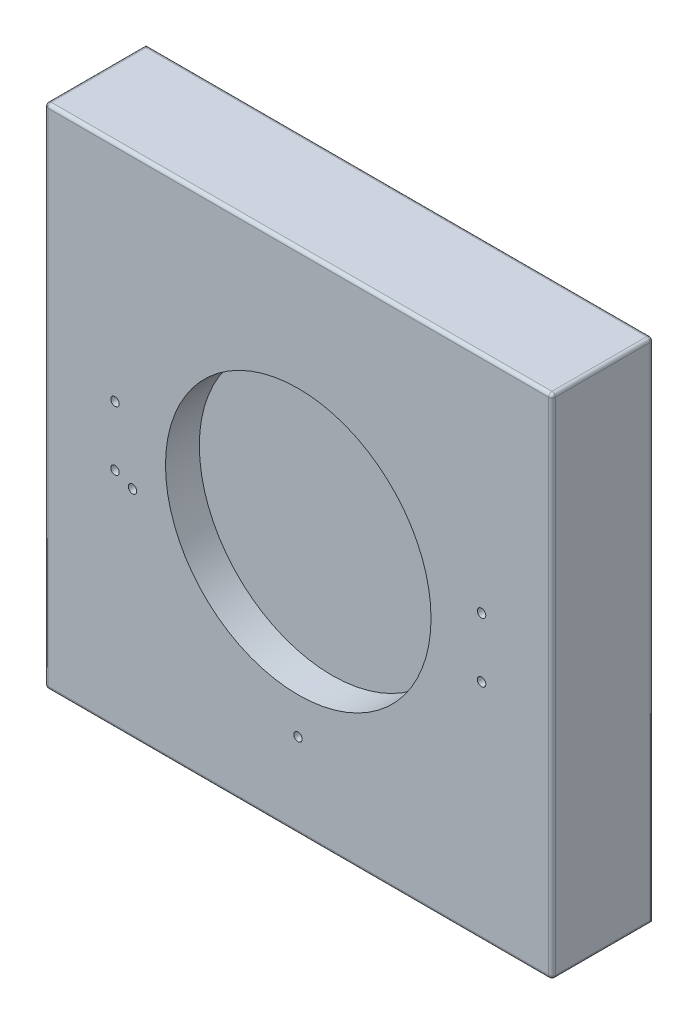
ISO-10303-21;
HEADER;
FILE_DESCRIPTION(('STEP AP214'),'2;1');
FILE_NAME('part.step','',(''),(''),'','','');
FILE_SCHEMA(('AUTOMOTIVE_DESIGN { 1 0 10303 214 1 1 1 1 }'));
ENDSEC;
DATA;
#1=APPLICATION_CONTEXT('core data for automotive mechanical design processes');
#2=APPLICATION_PROTOCOL_DEFINITION('international standard','automotive_design',2000,#1);
#3=PRODUCT_CONTEXT('',#1,'mechanical');
#4=PRODUCT('Part','Part','',(#3));
#5=PRODUCT_RELATED_PRODUCT_CATEGORY('part','',(#4));
#6=PRODUCT_DEFINITION_FORMATION('','',#4);
#7=PRODUCT_DEFINITION_CONTEXT('part definition',#1,'design');
#8=PRODUCT_DEFINITION('design','',#6,#7);
#9=PRODUCT_DEFINITION_SHAPE('','',#8);
#10=(LENGTH_UNIT() NAMED_UNIT(*) SI_UNIT(.MILLI.,.METRE.));
#11=(NAMED_UNIT(*) PLANE_ANGLE_UNIT() SI_UNIT($,.RADIAN.));
#12=(NAMED_UNIT(*) SI_UNIT($,.STERADIAN.) SOLID_ANGLE_UNIT());
#13=UNCERTAINTY_MEASURE_WITH_UNIT(LENGTH_MEASURE(1.E-05),#10,'distance_accuracy_value','');
#14=(GEOMETRIC_REPRESENTATION_CONTEXT(3) GLOBAL_UNCERTAINTY_ASSIGNED_CONTEXT((#13)) GLOBAL_UNIT_ASSIGNED_CONTEXT((#10,
#11,#12)) REPRESENTATION_CONTEXT('',''));
#15=CARTESIAN_POINT('',(0.,0.,0.));
#16=DIRECTION('',(0.,0.,1.));
#17=DIRECTION('',(1.,0.,0.));
#18=AXIS2_PLACEMENT_3D('',#15,#16,#17);
#19=CARTESIAN_POINT('',(-75.,-75.,-30.));
#20=DIRECTION('',(0.,-1.,0.));
#21=DIRECTION('',(0.,0.,-1.));
#22=AXIS2_PLACEMENT_3D('',#19,#20,#21);
#23=PLANE('',#22);
#24=DIRECTION('',(1.,0.,0.));
#25=VECTOR('',#24,1.);
#26=CARTESIAN_POINT('',(-75.,-75.,-30.));
#27=LINE('',#26,#25);
#28=CARTESIAN_POINT('',(-74.,-75.,-30.));
#29=VERTEX_POINT('',#28);
#30=CARTESIAN_POINT('',(74.,-75.,-30.));
#31=VERTEX_POINT('',#30);
#32=EDGE_CURVE('E127',#29,#31,#27,.T.);
#33=ORIENTED_EDGE('',*,*,#32,.T.);
#34=DIRECTION('',(0.,0.,1.));
#35=VECTOR('',#34,1.);
#36=CARTESIAN_POINT('',(74.,-75.,-30.));
#37=LINE('',#36,#35);
#38=CARTESIAN_POINT('',(74.,-75.,-1.));
#39=VERTEX_POINT('',#38);
#40=EDGE_CURVE('E136',#31,#39,#37,.T.);
#41=ORIENTED_EDGE('',*,*,#40,.T.);
#42=DIRECTION('',(1.,0.,0.));
#43=VECTOR('',#42,1.);
#44=CARTESIAN_POINT('',(-75.,-75.,-1.));
#45=LINE('',#44,#43);
#46=CARTESIAN_POINT('',(-74.,-75.,-1.));
#47=VERTEX_POINT('',#46);
#48=EDGE_CURVE('E130',#39,#47,#45,.F.);
#49=ORIENTED_EDGE('',*,*,#48,.T.);
#50=DIRECTION('',(0.,0.,1.));
#51=VECTOR('',#50,1.);
#52=CARTESIAN_POINT('',(-74.,-75.,-30.));
#53=LINE('',#52,#51);
#54=EDGE_CURVE('E124',#47,#29,#53,.F.);
#55=ORIENTED_EDGE('',*,*,#54,.T.);
#56=EDGE_LOOP('',(#33,#41,#49,#55));
#57=FACE_BOUND('',#56,.T.);
#58=ADVANCED_FACE('F40',(#57),#23,.T.);
#59=CARTESIAN_POINT('',(-75.,-75.,-30.));
#60=DIRECTION('',(1.,0.,0.));
#61=DIRECTION('',(0.,0.,-1.));
#62=AXIS2_PLACEMENT_3D('',#59,#60,#61);
#63=PLANE('',#62);
#64=DIRECTION('',(0.,1.,0.));
#65=VECTOR('',#64,1.);
#66=CARTESIAN_POINT('',(-75.,-75.,-30.));
#67=LINE('',#66,#65);
#68=CARTESIAN_POINT('',(-75.,-74.,-30.));
#69=VERTEX_POINT('',#68);
#70=CARTESIAN_POINT('',(-75.,74.,-30.));
#71=VERTEX_POINT('',#70);
#72=EDGE_CURVE('E146',#69,#71,#67,.T.);
#73=ORIENTED_EDGE('',*,*,#72,.F.);
#74=DIRECTION('',(0.,0.,1.));
#75=VECTOR('',#74,1.);
#76=CARTESIAN_POINT('',(-75.,-74.,0.));
#77=LINE('',#76,#75);
#78=CARTESIAN_POINT('',(-75.,-74.,-1.));
#79=VERTEX_POINT('',#78);
#80=EDGE_CURVE('E150',#69,#79,#77,.T.);
#81=ORIENTED_EDGE('',*,*,#80,.T.);
#82=DIRECTION('',(0.,1.,0.));
#83=VECTOR('',#82,1.);
#84=CARTESIAN_POINT('',(-75.,75.,-1.));
#85=LINE('',#84,#83);
#86=CARTESIAN_POINT('',(-75.,74.,-1.));
#87=VERTEX_POINT('',#86);
#88=EDGE_CURVE('E291',#79,#87,#85,.T.);
#89=ORIENTED_EDGE('',*,*,#88,.T.);
#90=DIRECTION('',(0.,0.,1.));
#91=VECTOR('',#90,1.);
#92=CARTESIAN_POINT('',(-75.,74.,-30.));
#93=LINE('',#92,#91);
#94=EDGE_CURVE('E247',#87,#71,#93,.F.);
#95=ORIENTED_EDGE('',*,*,#94,.T.);
#96=EDGE_LOOP('',(#73,#81,#89,#95));
#97=FACE_BOUND('',#96,.T.);
#98=ADVANCED_FACE('F394',(#97),#63,.F.);
#99=CARTESIAN_POINT('',(-75.,75.,-30.));
#100=DIRECTION('',(0.,-1.,0.));
#101=DIRECTION('',(0.,0.,-1.));
#102=AXIS2_PLACEMENT_3D('',#99,#100,#101);
#103=PLANE('',#102);
#104=DIRECTION('',(1.,0.,0.));
#105=VECTOR('',#104,1.);
#106=CARTESIAN_POINT('',(-75.,75.,-29.));
#107=LINE('',#106,#105);
#108=CARTESIAN_POINT('',(74.,75.,-29.));
#109=VERTEX_POINT('',#108);
#110=CARTESIAN_POINT('',(-74.,75.,-29.));
#111=VERTEX_POINT('',#110);
#112=EDGE_CURVE('E164',#109,#111,#107,.F.);
#113=ORIENTED_EDGE('',*,*,#112,.T.);
#114=DIRECTION('',(0.,0.,1.));
#115=VECTOR('',#114,1.);
#116=CARTESIAN_POINT('',(-74.,75.,-30.));
#117=LINE('',#116,#115);
#118=CARTESIAN_POINT('',(-74.,75.,-1.));
#119=VERTEX_POINT('',#118);
#120=EDGE_CURVE('E167',#111,#119,#117,.T.);
#121=ORIENTED_EDGE('',*,*,#120,.T.);
#122=DIRECTION('',(1.,0.,0.));
#123=VECTOR('',#122,1.);
#124=CARTESIAN_POINT('',(75.,75.,-1.));
#125=LINE('',#124,#123);
#126=CARTESIAN_POINT('',(74.,75.,-1.));
#127=VERTEX_POINT('',#126);
#128=EDGE_CURVE('E152',#119,#127,#125,.T.);
#129=ORIENTED_EDGE('',*,*,#128,.T.);
#130=DIRECTION('',(0.,0.,1.));
#131=VECTOR('',#130,1.);
#132=CARTESIAN_POINT('',(74.,75.,-30.));
#133=LINE('',#132,#131);
#134=EDGE_CURVE('E156',#127,#109,#133,.F.);
#135=ORIENTED_EDGE('',*,*,#134,.T.);
#136=EDGE_LOOP('',(#113,#121,#129,#135));
#137=FACE_BOUND('',#136,.T.);
#138=ADVANCED_FACE('F251',(#137),#103,.F.);
#139=CARTESIAN_POINT('',(75.,-75.,-30.));
#140=DIRECTION('',(1.,0.,0.));
#141=DIRECTION('',(0.,0.,-1.));
#142=AXIS2_PLACEMENT_3D('',#139,#140,#141);
#143=PLANE('',#142);
#144=DIRECTION('',(0.,1.,0.));
#145=VECTOR('',#144,1.);
#146=CARTESIAN_POINT('',(75.,-75.,-1.));
#147=LINE('',#146,#145);
#148=CARTESIAN_POINT('',(75.,74.,-1.));
#149=VERTEX_POINT('',#148);
#150=CARTESIAN_POINT('',(75.,-74.,-1.));
#151=VERTEX_POINT('',#150);
#152=EDGE_CURVE('E278',#149,#151,#147,.F.);
#153=ORIENTED_EDGE('',*,*,#152,.T.);
#154=DIRECTION('',(0.,0.,1.));
#155=VECTOR('',#154,1.);
#156=CARTESIAN_POINT('',(75.,-74.,-30.));
#157=LINE('',#156,#155);
#158=CARTESIAN_POINT('',(75.,-74.,-29.));
#159=VERTEX_POINT('',#158);
#160=EDGE_CURVE('E288',#151,#159,#157,.F.);
#161=ORIENTED_EDGE('',*,*,#160,.T.);
#162=DIRECTION('',(0.,1.,0.));
#163=VECTOR('',#162,1.);
#164=CARTESIAN_POINT('',(75.,75.,-29.));
#165=LINE('',#164,#163);
#166=CARTESIAN_POINT('',(75.,74.,-29.));
#167=VERTEX_POINT('',#166);
#168=EDGE_CURVE('E272',#159,#167,#165,.T.);
#169=ORIENTED_EDGE('',*,*,#168,.T.);
#170=DIRECTION('',(0.,0.,1.));
#171=VECTOR('',#170,1.);
#172=CARTESIAN_POINT('',(75.,74.,0.));
#173=LINE('',#172,#171);
#174=EDGE_CURVE('E265',#167,#149,#173,.T.);
#175=ORIENTED_EDGE('',*,*,#174,.T.);
#176=EDGE_LOOP('',(#153,#161,#169,#175));
#177=FACE_BOUND('',#176,.T.);
#178=ADVANCED_FACE('F401',(#177),#143,.T.);
#179=CARTESIAN_POINT('',(0.,0.,-30.));
#180=DIRECTION('',(0.,0.,1.));
#181=DIRECTION('',(1.,0.,0.));
#182=AXIS2_PLACEMENT_3D('',#179,#180,#181);
#183=PLANE('',#182);
#184=CARTESIAN_POINT('',(-0.0838926930277757,-49.9999774777312,-30.));
#185=DIRECTION('',(0.,0.,1.));
#186=DIRECTION('',(1.,0.,0.));
#187=AXIS2_PLACEMENT_3D('',#184,#185,#186);
#188=CIRCLE('',#187,1.24999999999999);
#189=CARTESIAN_POINT('',(1.16610730697222,-49.9999774777312,-30.));
#190=VERTEX_POINT('',#189);
#191=EDGE_CURVE('E350',#190,#190,#188,.T.);
#192=ORIENTED_EDGE('',*,*,#191,.T.);
#193=EDGE_LOOP('',(#192));
#194=FACE_BOUND('',#193,.T.);
#195=CARTESIAN_POINT('',(-49.,-11.,-30.));
#196=DIRECTION('',(0.,0.,1.));
#197=DIRECTION('',(1.,0.,0.));
#198=AXIS2_PLACEMENT_3D('',#195,#196,#197);
#199=CIRCLE('',#198,1.24999999999999);
#200=CARTESIAN_POINT('',(-47.75,-11.,-30.));
#201=VERTEX_POINT('',#200);
#202=EDGE_CURVE('E342',#201,#201,#199,.T.);
#203=ORIENTED_EDGE('',*,*,#202,.T.);
#204=EDGE_LOOP('',(#203));
#205=FACE_BOUND('',#204,.T.);
#206=CARTESIAN_POINT('',(-54.190883487963,-8.80000000000003,-30.));
#207=DIRECTION('',(0.,0.,1.));
#208=DIRECTION('',(1.,0.,0.));
#209=AXIS2_PLACEMENT_3D('',#206,#207,#208);
#210=CIRCLE('',#209,1.24999999999999);
#211=CARTESIAN_POINT('',(-52.940883487963,-8.80000000000003,-30.));
#212=VERTEX_POINT('',#211);
#213=EDGE_CURVE('E334',#212,#212,#210,.T.);
#214=ORIENTED_EDGE('',*,*,#213,.T.);
#215=EDGE_LOOP('',(#214));
#216=FACE_BOUND('',#215,.T.);
#217=CARTESIAN_POINT('',(-54.190883487963,8.79999999999997,-30.));
#218=DIRECTION('',(0.,0.,1.));
#219=DIRECTION('',(1.,0.,0.));
#220=AXIS2_PLACEMENT_3D('',#217,#218,#219);
#221=CIRCLE('',#220,1.24999999999999);
#222=CARTESIAN_POINT('',(-52.940883487963,8.79999999999997,-30.));
#223=VERTEX_POINT('',#222);
#224=EDGE_CURVE('E326',#223,#223,#221,.T.);
#225=ORIENTED_EDGE('',*,*,#224,.T.);
#226=EDGE_LOOP('',(#225));
#227=FACE_BOUND('',#226,.T.);
#228=CARTESIAN_POINT('',(54.1908834879629,-8.80000000000003,-30.));
#229=DIRECTION('',(0.,0.,1.));
#230=DIRECTION('',(1.,0.,0.));
#231=AXIS2_PLACEMENT_3D('',#228,#229,#230);
#232=CIRCLE('',#231,1.24999999999999);
#233=CARTESIAN_POINT('',(55.4408834879629,-8.80000000000003,-30.));
#234=VERTEX_POINT('',#233);
#235=EDGE_CURVE('E318',#234,#234,#232,.T.);
#236=ORIENTED_EDGE('',*,*,#235,.T.);
#237=EDGE_LOOP('',(#236));
#238=FACE_BOUND('',#237,.T.);
#239=CARTESIAN_POINT('',(54.1908834879629,8.79999999999998,-30.));
#240=DIRECTION('',(0.,0.,1.));
#241=DIRECTION('',(1.,0.,0.));
#242=AXIS2_PLACEMENT_3D('',#239,#240,#241);
#243=CIRCLE('',#242,1.24999999999999);
#244=CARTESIAN_POINT('',(55.4408834879629,8.79999999999998,-30.));
#245=VERTEX_POINT('',#244);
#246=EDGE_CURVE('E307',#245,#245,#243,.T.);
#247=ORIENTED_EDGE('',*,*,#246,.T.);
#248=EDGE_LOOP('',(#247));
#249=FACE_BOUND('',#248,.T.);
#250=ORIENTED_EDGE('',*,*,#32,.F.);
#251=CARTESIAN_POINT('',(-74.,-74.,-30.));
#252=DIRECTION('',(0.,0.,1.));
#253=DIRECTION('',(1.,0.,0.));
#254=AXIS2_PLACEMENT_3D('',#251,#252,#253);
#255=CIRCLE('',#254,1.);
#256=EDGE_CURVE('E141',#29,#69,#255,.F.);
#257=ORIENTED_EDGE('',*,*,#256,.T.);
#258=ORIENTED_EDGE('',*,*,#72,.T.);
#259=DIRECTION('',(1.,0.,0.));
#260=VECTOR('',#259,1.);
#261=CARTESIAN_POINT('',(0.,74.,-30.));
#262=LINE('',#261,#260);
#263=CARTESIAN_POINT('',(74.,74.,-30.));
#264=VERTEX_POINT('',#263);
#265=EDGE_CURVE('E158',#71,#264,#262,.T.);
#266=ORIENTED_EDGE('',*,*,#265,.T.);
#267=DIRECTION('',(0.,1.,0.));
#268=VECTOR('',#267,1.);
#269=CARTESIAN_POINT('',(74.,-75.,-30.));
#270=LINE('',#269,#268);
#271=EDGE_CURVE('E144',#264,#31,#270,.F.);
#272=ORIENTED_EDGE('',*,*,#271,.T.);
#273=EDGE_LOOP('',(#250,#257,#258,#266,#272));
#274=FACE_BOUND('',#273,.T.);
#275=ADVANCED_FACE('F139',(#194,#205,#216,#227,#238,#249,#274),#183,.F.);
#276=CARTESIAN_POINT('',(0.,0.,0.));
#277=DIRECTION('',(0.,0.,1.));
#278=DIRECTION('',(1.,0.,0.));
#279=AXIS2_PLACEMENT_3D('',#276,#277,#278);
#280=PLANE('',#279);
#281=CARTESIAN_POINT('',(-0.0838926930277757,-49.9999774777312,0.));
#282=DIRECTION('',(0.,0.,1.));
#283=DIRECTION('',(1.,0.,0.));
#284=AXIS2_PLACEMENT_3D('',#281,#282,#283);
#285=CIRCLE('',#284,1.25);
#286=CARTESIAN_POINT('',(1.16610730697222,-49.9999774777312,0.));
#287=VERTEX_POINT('',#286);
#288=EDGE_CURVE('E354',#287,#287,#285,.T.);
#289=ORIENTED_EDGE('',*,*,#288,.F.);
#290=EDGE_LOOP('',(#289));
#291=FACE_BOUND('',#290,.T.);
#292=CARTESIAN_POINT('',(-49.,-11.,0.));
#293=DIRECTION('',(0.,0.,1.));
#294=DIRECTION('',(1.,0.,0.));
#295=AXIS2_PLACEMENT_3D('',#292,#293,#294);
#296=CIRCLE('',#295,1.24999999999999);
#297=CARTESIAN_POINT('',(-47.75,-11.,0.));
#298=VERTEX_POINT('',#297);
#299=EDGE_CURVE('E346',#298,#298,#296,.T.);
#300=ORIENTED_EDGE('',*,*,#299,.F.);
#301=EDGE_LOOP('',(#300));
#302=FACE_BOUND('',#301,.T.);
#303=CARTESIAN_POINT('',(-54.190883487963,-8.80000000000003,0.));
#304=DIRECTION('',(0.,0.,1.));
#305=DIRECTION('',(1.,0.,0.));
#306=AXIS2_PLACEMENT_3D('',#303,#304,#305);
#307=CIRCLE('',#306,1.24999999999999);
#308=CARTESIAN_POINT('',(-52.940883487963,-8.80000000000003,0.));
#309=VERTEX_POINT('',#308);
#310=EDGE_CURVE('E338',#309,#309,#307,.T.);
#311=ORIENTED_EDGE('',*,*,#310,.F.);
#312=EDGE_LOOP('',(#311));
#313=FACE_BOUND('',#312,.T.);
#314=CARTESIAN_POINT('',(-54.190883487963,8.79999999999997,0.));
#315=DIRECTION('',(0.,0.,1.));
#316=DIRECTION('',(1.,0.,0.));
#317=AXIS2_PLACEMENT_3D('',#314,#315,#316);
#318=CIRCLE('',#317,1.24999999999999);
#319=CARTESIAN_POINT('',(-52.940883487963,8.79999999999997,0.));
#320=VERTEX_POINT('',#319);
#321=EDGE_CURVE('E330',#320,#320,#318,.T.);
#322=ORIENTED_EDGE('',*,*,#321,.F.);
#323=EDGE_LOOP('',(#322));
#324=FACE_BOUND('',#323,.T.);
#325=CARTESIAN_POINT('',(54.1908834879629,-8.80000000000003,0.));
#326=DIRECTION('',(0.,0.,1.));
#327=DIRECTION('',(1.,0.,0.));
#328=AXIS2_PLACEMENT_3D('',#325,#326,#327);
#329=CIRCLE('',#328,1.24999999999999);
#330=CARTESIAN_POINT('',(55.4408834879629,-8.80000000000003,0.));
#331=VERTEX_POINT('',#330);
#332=EDGE_CURVE('E322',#331,#331,#329,.T.);
#333=ORIENTED_EDGE('',*,*,#332,.F.);
#334=EDGE_LOOP('',(#333));
#335=FACE_BOUND('',#334,.T.);
#336=CARTESIAN_POINT('',(54.1908834879629,8.79999999999998,0.));
#337=DIRECTION('',(0.,0.,1.));
#338=DIRECTION('',(1.,0.,0.));
#339=AXIS2_PLACEMENT_3D('',#336,#337,#338);
#340=CIRCLE('',#339,1.24999999999999);
#341=CARTESIAN_POINT('',(55.4408834879629,8.79999999999998,0.));
#342=VERTEX_POINT('',#341);
#343=EDGE_CURVE('E314',#342,#342,#340,.T.);
#344=ORIENTED_EDGE('',*,*,#343,.F.);
#345=EDGE_LOOP('',(#344));
#346=FACE_BOUND('',#345,.T.);
#347=CARTESIAN_POINT('',(0.,0.,0.));
#348=DIRECTION('',(0.,0.,1.));
#349=DIRECTION('',(1.,0.,0.));
#350=AXIS2_PLACEMENT_3D('',#347,#348,#349);
#351=CIRCLE('',#350,39.25);
#352=CARTESIAN_POINT('',(39.25,0.,0.));
#353=VERTEX_POINT('',#352);
#354=EDGE_CURVE('E303',#353,#353,#351,.T.);
#355=ORIENTED_EDGE('',*,*,#354,.F.);
#356=EDGE_LOOP('',(#355));
#357=FACE_BOUND('',#356,.T.);
#358=DIRECTION('',(0.,1.,0.));
#359=VECTOR('',#358,1.);
#360=CARTESIAN_POINT('',(-74.,-75.,0.));
#361=LINE('',#360,#359);
#362=CARTESIAN_POINT('',(-74.,74.,0.));
#363=VERTEX_POINT('',#362);
#364=CARTESIAN_POINT('',(-74.,-74.,0.));
#365=VERTEX_POINT('',#364);
#366=EDGE_CURVE('E50',#363,#365,#361,.F.);
#367=ORIENTED_EDGE('',*,*,#366,.T.);
#368=DIRECTION('',(1.,0.,0.));
#369=VECTOR('',#368,1.);
#370=CARTESIAN_POINT('',(0.,-74.,0.));
#371=LINE('',#370,#369);
#372=CARTESIAN_POINT('',(74.,-74.,0.));
#373=VERTEX_POINT('',#372);
#374=EDGE_CURVE('E11',#365,#373,#371,.T.);
#375=ORIENTED_EDGE('',*,*,#374,.T.);
#376=DIRECTION('',(0.,1.,0.));
#377=VECTOR('',#376,1.);
#378=CARTESIAN_POINT('',(74.,0.,0.));
#379=LINE('',#378,#377);
#380=CARTESIAN_POINT('',(74.,74.,0.));
#381=VERTEX_POINT('',#380);
#382=EDGE_CURVE('E174',#373,#381,#379,.T.);
#383=ORIENTED_EDGE('',*,*,#382,.T.);
#384=DIRECTION('',(1.,0.,0.));
#385=VECTOR('',#384,1.);
#386=CARTESIAN_POINT('',(-75.,74.,0.));
#387=LINE('',#386,#385);
#388=EDGE_CURVE('E171',#381,#363,#387,.F.);
#389=ORIENTED_EDGE('',*,*,#388,.T.);
#390=EDGE_LOOP('',(#367,#375,#383,#389));
#391=FACE_BOUND('',#390,.T.);
#392=ADVANCED_FACE('F361',(#291,#302,#313,#324,#335,#346,#357,#391),#280,.T.);
#393=CARTESIAN_POINT('',(-74.,74.,-1.));
#394=DIRECTION('',(-1.,0.,0.));
#395=DIRECTION('',(0.,0.,1.));
#396=AXIS2_PLACEMENT_3D('',#393,#394,#395);
#397=SPHERICAL_SURFACE('',#396,1.);
#398=CARTESIAN_POINT('',(-74.,74.,-1.));
#399=DIRECTION('',(-1.,0.,0.));
#400=DIRECTION('',(0.,0.,1.));
#401=AXIS2_PLACEMENT_3D('',#398,#399,#400);
#402=CIRCLE('',#401,1.);
#403=EDGE_CURVE('E230',#119,#363,#402,.F.);
#404=ORIENTED_EDGE('',*,*,#403,.F.);
#405=CARTESIAN_POINT('',(-74.,74.,-1.));
#406=DIRECTION('',(0.,0.,1.));
#407=DIRECTION('',(1.,0.,0.));
#408=AXIS2_PLACEMENT_3D('',#405,#406,#407);
#409=CIRCLE('',#408,1.);
#410=EDGE_CURVE('E44',#87,#119,#409,.F.);
#411=ORIENTED_EDGE('',*,*,#410,.F.);
#412=CARTESIAN_POINT('',(-74.,74.,-1.));
#413=DIRECTION('',(0.,1.,0.));
#414=DIRECTION('',(0.,0.,1.));
#415=AXIS2_PLACEMENT_3D('',#412,#413,#414);
#416=CIRCLE('',#415,1.);
#417=EDGE_CURVE('E233',#363,#87,#416,.F.);
#418=ORIENTED_EDGE('',*,*,#417,.F.);
#419=EDGE_LOOP('',(#404,#411,#418));
#420=FACE_BOUND('',#419,.T.);
#421=ADVANCED_FACE('F42',(#420),#397,.T.);
#422=CARTESIAN_POINT('',(-74.,74.,-30.));
#423=DIRECTION('',(0.,0.,1.));
#424=DIRECTION('',(1.,0.,0.));
#425=AXIS2_PLACEMENT_3D('',#422,#423,#424);
#426=CYLINDRICAL_SURFACE('',#425,1.);
#427=ORIENTED_EDGE('',*,*,#410,.T.);
#428=ORIENTED_EDGE('',*,*,#120,.F.);
#429=CARTESIAN_POINT('',(-74.,74.,-29.));
#430=DIRECTION('',(0.707106781186547,0.,-0.707106781186547));
#431=DIRECTION('',(0.707106781186547,0.,0.707106781186547));
#432=AXIS2_PLACEMENT_3D('',#429,#430,#431);
#433=ELLIPSE('',#432,1.41421356237309,1.);
#434=EDGE_CURVE('E226',#71,#111,#433,.T.);
#435=ORIENTED_EDGE('',*,*,#434,.F.);
#436=ORIENTED_EDGE('',*,*,#94,.F.);
#437=EDGE_LOOP('',(#427,#428,#435,#436));
#438=FACE_BOUND('',#437,.T.);
#439=ADVANCED_FACE('F245',(#438),#426,.T.);
#440=CARTESIAN_POINT('',(-74.,-74.,-30.));
#441=DIRECTION('',(0.,0.,-1.));
#442=DIRECTION('',(-1.,0.,0.));
#443=AXIS2_PLACEMENT_3D('',#440,#441,#442);
#444=CYLINDRICAL_SURFACE('',#443,1.);
#445=ORIENTED_EDGE('',*,*,#256,.F.);
#446=ORIENTED_EDGE('',*,*,#54,.F.);
#447=CARTESIAN_POINT('',(-74.,-74.,-1.));
#448=DIRECTION('',(0.,0.,1.));
#449=DIRECTION('',(0.,-1.,0.));
#450=AXIS2_PLACEMENT_3D('',#447,#448,#449);
#451=CIRCLE('',#450,1.);
#452=EDGE_CURVE('E223',#79,#47,#451,.T.);
#453=ORIENTED_EDGE('',*,*,#452,.F.);
#454=ORIENTED_EDGE('',*,*,#80,.F.);
#455=EDGE_LOOP('',(#445,#446,#453,#454));
#456=FACE_BOUND('',#455,.T.);
#457=ADVANCED_FACE('F149',(#456),#444,.T.);
#458=CARTESIAN_POINT('',(-74.,-75.,-1.));
#459=DIRECTION('',(0.,-1.,0.));
#460=DIRECTION('',(0.,0.,-1.));
#461=AXIS2_PLACEMENT_3D('',#458,#459,#460);
#462=CYLINDRICAL_SURFACE('',#461,1.);
#463=ORIENTED_EDGE('',*,*,#417,.T.);
#464=ORIENTED_EDGE('',*,*,#88,.F.);
#465=CARTESIAN_POINT('',(-74.,-74.,-1.));
#466=DIRECTION('',(0.,-1.,0.));
#467=DIRECTION('',(0.,0.,-1.));
#468=AXIS2_PLACEMENT_3D('',#465,#466,#467);
#469=CIRCLE('',#468,1.);
#470=EDGE_CURVE('E219',#365,#79,#469,.T.);
#471=ORIENTED_EDGE('',*,*,#470,.F.);
#472=ORIENTED_EDGE('',*,*,#366,.F.);
#473=EDGE_LOOP('',(#463,#464,#471,#472));
#474=FACE_BOUND('',#473,.T.);
#475=ADVANCED_FACE('F433',(#474),#462,.T.);
#476=CARTESIAN_POINT('',(-75.,74.,-1.));
#477=DIRECTION('',(-1.,0.,0.));
#478=DIRECTION('',(0.,0.,1.));
#479=AXIS2_PLACEMENT_3D('',#476,#477,#478);
#480=CYLINDRICAL_SURFACE('',#479,1.);
#481=ORIENTED_EDGE('',*,*,#403,.T.);
#482=ORIENTED_EDGE('',*,*,#388,.F.);
#483=CARTESIAN_POINT('',(74.,74.,-1.));
#484=DIRECTION('',(1.,0.,0.));
#485=DIRECTION('',(0.,0.,-1.));
#486=AXIS2_PLACEMENT_3D('',#483,#484,#485);
#487=CIRCLE('',#486,1.);
#488=EDGE_CURVE('E215',#127,#381,#487,.T.);
#489=ORIENTED_EDGE('',*,*,#488,.F.);
#490=ORIENTED_EDGE('',*,*,#128,.F.);
#491=EDGE_LOOP('',(#481,#482,#489,#490));
#492=FACE_BOUND('',#491,.T.);
#493=ADVANCED_FACE('F430',(#492),#480,.T.);
#494=CARTESIAN_POINT('',(74.,74.,-30.));
#495=DIRECTION('',(0.,0.,-1.));
#496=DIRECTION('',(-1.,0.,0.));
#497=AXIS2_PLACEMENT_3D('',#494,#495,#496);
#498=CYLINDRICAL_SURFACE('',#497,1.);
#499=CARTESIAN_POINT('',(74.,74.,-29.));
#500=DIRECTION('',(0.,0.,-1.));
#501=DIRECTION('',(-1.,0.,0.));
#502=AXIS2_PLACEMENT_3D('',#499,#500,#501);
#503=CIRCLE('',#502,1.);
#504=EDGE_CURVE('E207',#109,#167,#503,.T.);
#505=ORIENTED_EDGE('',*,*,#504,.F.);
#506=ORIENTED_EDGE('',*,*,#134,.F.);
#507=CARTESIAN_POINT('',(74.,74.,-1.));
#508=DIRECTION('',(0.,0.,1.));
#509=DIRECTION('',(0.,-1.,0.));
#510=AXIS2_PLACEMENT_3D('',#507,#508,#509);
#511=CIRCLE('',#510,1.);
#512=EDGE_CURVE('E211',#149,#127,#511,.T.);
#513=ORIENTED_EDGE('',*,*,#512,.F.);
#514=ORIENTED_EDGE('',*,*,#174,.F.);
#515=EDGE_LOOP('',(#505,#506,#513,#514));
#516=FACE_BOUND('',#515,.T.);
#517=ADVANCED_FACE('F262',(#516),#498,.T.);
#518=CARTESIAN_POINT('',(0.,74.,-29.));
#519=DIRECTION('',(1.,0.,0.));
#520=DIRECTION('',(0.,0.,-1.));
#521=AXIS2_PLACEMENT_3D('',#518,#519,#520);
#522=CYLINDRICAL_SURFACE('',#521,1.);
#523=ORIENTED_EDGE('',*,*,#434,.T.);
#524=ORIENTED_EDGE('',*,*,#112,.F.);
#525=CARTESIAN_POINT('',(74.,74.,-29.));
#526=DIRECTION('',(1.,0.,0.));
#527=DIRECTION('',(0.,0.,-1.));
#528=AXIS2_PLACEMENT_3D('',#525,#526,#527);
#529=CIRCLE('',#528,1.);
#530=EDGE_CURVE('E203',#264,#109,#529,.T.);
#531=ORIENTED_EDGE('',*,*,#530,.F.);
#532=ORIENTED_EDGE('',*,*,#265,.F.);
#533=EDGE_LOOP('',(#523,#524,#531,#532));
#534=FACE_BOUND('',#533,.T.);
#535=ADVANCED_FACE('F257',(#534),#522,.T.);
#536=CARTESIAN_POINT('',(-74.,-74.,-1.));
#537=DIRECTION('',(-1.,0.,0.));
#538=DIRECTION('',(0.,0.,1.));
#539=AXIS2_PLACEMENT_3D('',#536,#537,#538);
#540=SPHERICAL_SURFACE('',#539,1.);
#541=ORIENTED_EDGE('',*,*,#470,.T.);
#542=ORIENTED_EDGE('',*,*,#452,.T.);
#543=CARTESIAN_POINT('',(-74.,-74.,-1.));
#544=DIRECTION('',(-1.,0.,0.));
#545=DIRECTION('',(0.,0.,1.));
#546=AXIS2_PLACEMENT_3D('',#543,#544,#545);
#547=CIRCLE('',#546,1.);
#548=EDGE_CURVE('E199',#365,#47,#547,.F.);
#549=ORIENTED_EDGE('',*,*,#548,.F.);
#550=EDGE_LOOP('',(#541,#542,#549));
#551=FACE_BOUND('',#550,.T.);
#552=ADVANCED_FACE('F421',(#551),#540,.T.);
#553=CARTESIAN_POINT('',(74.,74.,-1.));
#554=DIRECTION('',(0.,1.,0.));
#555=DIRECTION('',(0.,0.,1.));
#556=AXIS2_PLACEMENT_3D('',#553,#554,#555);
#557=SPHERICAL_SURFACE('',#556,1.);
#558=ORIENTED_EDGE('',*,*,#512,.T.);
#559=ORIENTED_EDGE('',*,*,#488,.T.);
#560=CARTESIAN_POINT('',(74.,74.,-1.));
#561=DIRECTION('',(0.,1.,0.));
#562=DIRECTION('',(0.,0.,1.));
#563=AXIS2_PLACEMENT_3D('',#560,#561,#562);
#564=CIRCLE('',#563,1.);
#565=EDGE_CURVE('E195',#149,#381,#564,.F.);
#566=ORIENTED_EDGE('',*,*,#565,.F.);
#567=EDGE_LOOP('',(#558,#559,#566));
#568=FACE_BOUND('',#567,.T.);
#569=ADVANCED_FACE('F418',(#568),#557,.T.);
#570=CARTESIAN_POINT('',(74.,74.,-29.));
#571=DIRECTION('',(0.,1.,0.));
#572=DIRECTION('',(0.,0.,1.));
#573=AXIS2_PLACEMENT_3D('',#570,#571,#572);
#574=SPHERICAL_SURFACE('',#573,1.);
#575=ORIENTED_EDGE('',*,*,#530,.T.);
#576=ORIENTED_EDGE('',*,*,#504,.T.);
#577=CARTESIAN_POINT('',(74.,74.,-29.));
#578=DIRECTION('',(0.,1.,0.));
#579=DIRECTION('',(0.,0.,1.));
#580=AXIS2_PLACEMENT_3D('',#577,#578,#579);
#581=CIRCLE('',#580,1.);
#582=EDGE_CURVE('E191',#264,#167,#581,.F.);
#583=ORIENTED_EDGE('',*,*,#582,.F.);
#584=EDGE_LOOP('',(#575,#576,#583));
#585=FACE_BOUND('',#584,.T.);
#586=ADVANCED_FACE('F267',(#585),#574,.T.);
#587=CARTESIAN_POINT('',(0.,-74.,-1.));
#588=DIRECTION('',(1.,0.,0.));
#589=DIRECTION('',(0.,0.,-1.));
#590=AXIS2_PLACEMENT_3D('',#587,#588,#589);
#591=CYLINDRICAL_SURFACE('',#590,1.);
#592=ORIENTED_EDGE('',*,*,#548,.T.);
#593=ORIENTED_EDGE('',*,*,#48,.F.);
#594=CARTESIAN_POINT('',(74.,-74.,-1.));
#595=DIRECTION('',(1.,0.,0.));
#596=DIRECTION('',(0.,0.,-1.));
#597=AXIS2_PLACEMENT_3D('',#594,#595,#596);
#598=CIRCLE('',#597,1.);
#599=EDGE_CURVE('E188',#373,#39,#598,.T.);
#600=ORIENTED_EDGE('',*,*,#599,.F.);
#601=ORIENTED_EDGE('',*,*,#374,.F.);
#602=EDGE_LOOP('',(#592,#593,#600,#601));
#603=FACE_BOUND('',#602,.T.);
#604=ADVANCED_FACE('F411',(#603),#591,.T.);
#605=CARTESIAN_POINT('',(74.,0.,-1.));
#606=DIRECTION('',(0.,1.,0.));
#607=DIRECTION('',(0.,0.,1.));
#608=AXIS2_PLACEMENT_3D('',#605,#606,#607);
#609=CYLINDRICAL_SURFACE('',#608,1.);
#610=ORIENTED_EDGE('',*,*,#565,.T.);
#611=ORIENTED_EDGE('',*,*,#382,.F.);
#612=CARTESIAN_POINT('',(74.,-74.,-1.));
#613=DIRECTION('',(0.,-1.,0.));
#614=DIRECTION('',(0.,0.,-1.));
#615=AXIS2_PLACEMENT_3D('',#612,#613,#614);
#616=CIRCLE('',#615,1.);
#617=EDGE_CURVE('E64',#151,#373,#616,.T.);
#618=ORIENTED_EDGE('',*,*,#617,.F.);
#619=ORIENTED_EDGE('',*,*,#152,.F.);
#620=EDGE_LOOP('',(#610,#611,#618,#619));
#621=FACE_BOUND('',#620,.T.);
#622=ADVANCED_FACE('F408',(#621),#609,.T.);
#623=CARTESIAN_POINT('',(74.,-75.,-29.));
#624=DIRECTION('',(0.,-1.,0.));
#625=DIRECTION('',(0.,0.,-1.));
#626=AXIS2_PLACEMENT_3D('',#623,#624,#625);
#627=CYLINDRICAL_SURFACE('',#626,1.);
#628=ORIENTED_EDGE('',*,*,#582,.T.);
#629=ORIENTED_EDGE('',*,*,#168,.F.);
#630=CARTESIAN_POINT('',(74.,-74.,-29.));
#631=DIRECTION('',(0.,-0.707106781186547,0.707106781186547));
#632=DIRECTION('',(0.,-0.707106781186547,-0.707106781186547));
#633=AXIS2_PLACEMENT_3D('',#630,#631,#632);
#634=ELLIPSE('',#633,1.41421356237309,1.);
#635=EDGE_CURVE('E182',#31,#159,#634,.T.);
#636=ORIENTED_EDGE('',*,*,#635,.F.);
#637=ORIENTED_EDGE('',*,*,#271,.F.);
#638=EDGE_LOOP('',(#628,#629,#636,#637));
#639=FACE_BOUND('',#638,.T.);
#640=ADVANCED_FACE('F270',(#639),#627,.T.);
#641=CARTESIAN_POINT('',(74.,-74.,-1.));
#642=DIRECTION('',(0.,0.,1.));
#643=DIRECTION('',(1.,0.,0.));
#644=AXIS2_PLACEMENT_3D('',#641,#642,#643);
#645=SPHERICAL_SURFACE('',#644,1.);
#646=ORIENTED_EDGE('',*,*,#617,.T.);
#647=ORIENTED_EDGE('',*,*,#599,.T.);
#648=CARTESIAN_POINT('',(74.,-74.,-1.));
#649=DIRECTION('',(0.,0.,1.));
#650=DIRECTION('',(1.,0.,0.));
#651=AXIS2_PLACEMENT_3D('',#648,#649,#650);
#652=CIRCLE('',#651,1.);
#653=EDGE_CURVE('E179',#151,#39,#652,.F.);
#654=ORIENTED_EDGE('',*,*,#653,.F.);
#655=EDGE_LOOP('',(#646,#647,#654));
#656=FACE_BOUND('',#655,.T.);
#657=ADVANCED_FACE('F389',(#656),#645,.T.);
#658=CARTESIAN_POINT('',(74.,-74.,-30.));
#659=DIRECTION('',(0.,0.,1.));
#660=DIRECTION('',(1.,0.,0.));
#661=AXIS2_PLACEMENT_3D('',#658,#659,#660);
#662=CYLINDRICAL_SURFACE('',#661,1.);
#663=ORIENTED_EDGE('',*,*,#635,.T.);
#664=ORIENTED_EDGE('',*,*,#160,.F.);
#665=ORIENTED_EDGE('',*,*,#653,.T.);
#666=ORIENTED_EDGE('',*,*,#40,.F.);
#667=EDGE_LOOP('',(#663,#664,#665,#666));
#668=FACE_BOUND('',#667,.T.);
#669=ADVANCED_FACE('F276',(#668),#662,.T.);
#670=CARTESIAN_POINT('',(0.,0.,-10.));
#671=DIRECTION('',(0.,0.,1.));
#672=DIRECTION('',(1.,0.,0.));
#673=AXIS2_PLACEMENT_3D('',#670,#671,#672);
#674=CYLINDRICAL_SURFACE('',#673,39.25);
#675=CARTESIAN_POINT('',(0.,0.,-10.));
#676=DIRECTION('',(0.,0.,1.));
#677=DIRECTION('',(1.,0.,0.));
#678=AXIS2_PLACEMENT_3D('',#675,#676,#677);
#679=CIRCLE('',#678,39.25);
#680=CARTESIAN_POINT('',(39.25,0.,-10.));
#681=VERTEX_POINT('',#680);
#682=EDGE_CURVE('E183',#681,#681,#679,.T.);
#683=ORIENTED_EDGE('',*,*,#682,.F.);
#684=EDGE_LOOP('',(#683));
#685=FACE_BOUND('',#684,.T.);
#686=ORIENTED_EDGE('',*,*,#354,.T.);
#687=EDGE_LOOP('',(#686));
#688=FACE_BOUND('',#687,.T.);
#689=ADVANCED_FACE('F377',(#685,#688),#674,.F.);
#690=CARTESIAN_POINT('',(0.,0.,-10.));
#691=DIRECTION('',(0.,0.,1.));
#692=DIRECTION('',(1.,0.,0.));
#693=AXIS2_PLACEMENT_3D('',#690,#691,#692);
#694=PLANE('',#693);
#695=ORIENTED_EDGE('',*,*,#682,.T.);
#696=EDGE_LOOP('',(#695));
#697=FACE_BOUND('',#696,.T.);
#698=ADVANCED_FACE('F379',(#697),#694,.T.);
#699=CARTESIAN_POINT('',(54.1908834879629,8.79999999999998,0.));
#700=DIRECTION('',(0.,0.,1.));
#701=DIRECTION('',(1.,0.,0.));
#702=AXIS2_PLACEMENT_3D('',#699,#700,#701);
#703=CYLINDRICAL_SURFACE('',#702,1.24999999999999);
#704=ORIENTED_EDGE('',*,*,#246,.F.);
#705=EDGE_LOOP('',(#704));
#706=FACE_BOUND('',#705,.T.);
#707=ORIENTED_EDGE('',*,*,#343,.T.);
#708=EDGE_LOOP('',(#707));
#709=FACE_BOUND('',#708,.T.);
#710=ADVANCED_FACE('F386',(#706,#709),#703,.F.);
#711=CARTESIAN_POINT('',(54.1908834879629,-8.80000000000003,0.));
#712=DIRECTION('',(0.,0.,1.));
#713=DIRECTION('',(1.,0.,0.));
#714=AXIS2_PLACEMENT_3D('',#711,#712,#713);
#715=CYLINDRICAL_SURFACE('',#714,1.24999999999999);
#716=ORIENTED_EDGE('',*,*,#235,.F.);
#717=EDGE_LOOP('',(#716));
#718=FACE_BOUND('',#717,.T.);
#719=ORIENTED_EDGE('',*,*,#332,.T.);
#720=EDGE_LOOP('',(#719));
#721=FACE_BOUND('',#720,.T.);
#722=ADVANCED_FACE('F577',(#718,#721),#715,.F.);
#723=CARTESIAN_POINT('',(-54.190883487963,8.79999999999997,0.));
#724=DIRECTION('',(0.,0.,1.));
#725=DIRECTION('',(1.,0.,0.));
#726=AXIS2_PLACEMENT_3D('',#723,#724,#725);
#727=CYLINDRICAL_SURFACE('',#726,1.24999999999999);
#728=ORIENTED_EDGE('',*,*,#224,.F.);
#729=EDGE_LOOP('',(#728));
#730=FACE_BOUND('',#729,.T.);
#731=ORIENTED_EDGE('',*,*,#321,.T.);
#732=EDGE_LOOP('',(#731));
#733=FACE_BOUND('',#732,.T.);
#734=ADVANCED_FACE('F586',(#730,#733),#727,.F.);
#735=CARTESIAN_POINT('',(-54.190883487963,-8.80000000000003,0.));
#736=DIRECTION('',(0.,0.,1.));
#737=DIRECTION('',(1.,0.,0.));
#738=AXIS2_PLACEMENT_3D('',#735,#736,#737);
#739=CYLINDRICAL_SURFACE('',#738,1.24999999999999);
#740=ORIENTED_EDGE('',*,*,#213,.F.);
#741=EDGE_LOOP('',(#740));
#742=FACE_BOUND('',#741,.T.);
#743=ORIENTED_EDGE('',*,*,#310,.T.);
#744=EDGE_LOOP('',(#743));
#745=FACE_BOUND('',#744,.T.);
#746=ADVANCED_FACE('F595',(#742,#745),#739,.F.);
#747=CARTESIAN_POINT('',(-49.,-11.,0.));
#748=DIRECTION('',(0.,0.,1.));
#749=DIRECTION('',(1.,0.,0.));
#750=AXIS2_PLACEMENT_3D('',#747,#748,#749);
#751=CYLINDRICAL_SURFACE('',#750,1.24999999999999);
#752=ORIENTED_EDGE('',*,*,#202,.F.);
#753=EDGE_LOOP('',(#752));
#754=FACE_BOUND('',#753,.T.);
#755=ORIENTED_EDGE('',*,*,#299,.T.);
#756=EDGE_LOOP('',(#755));
#757=FACE_BOUND('',#756,.T.);
#758=ADVANCED_FACE('F604',(#754,#757),#751,.F.);
#759=CARTESIAN_POINT('',(-0.0838926930277757,-49.9999774777312,0.));
#760=DIRECTION('',(0.,0.,1.));
#761=DIRECTION('',(1.,0.,0.));
#762=AXIS2_PLACEMENT_3D('',#759,#760,#761);
#763=CYLINDRICAL_SURFACE('',#762,1.24999999999999);
#764=ORIENTED_EDGE('',*,*,#191,.F.);
#765=EDGE_LOOP('',(#764));
#766=FACE_BOUND('',#765,.T.);
#767=ORIENTED_EDGE('',*,*,#288,.T.);
#768=EDGE_LOOP('',(#767));
#769=FACE_BOUND('',#768,.T.);
#770=ADVANCED_FACE('F359',(#766,#769),#763,.F.);
#771=CLOSED_SHELL('',(#58,#98,#138,#178,#275,#392,#421,#439,#457,#475,#493,#517,#535,#552,#569,
#586,#604,#622,#640,#657,#669,#689,#698,#710,#722,#734,#746,#758,#770));
#772=MANIFOLD_SOLID_BREP('B2',#771);
#773=ADVANCED_BREP_SHAPE_REPRESENTATION('',(#18,#772),#14);
#774=SHAPE_DEFINITION_REPRESENTATION(#9,#773);
ENDSEC;
END-ISO-10303-21;
